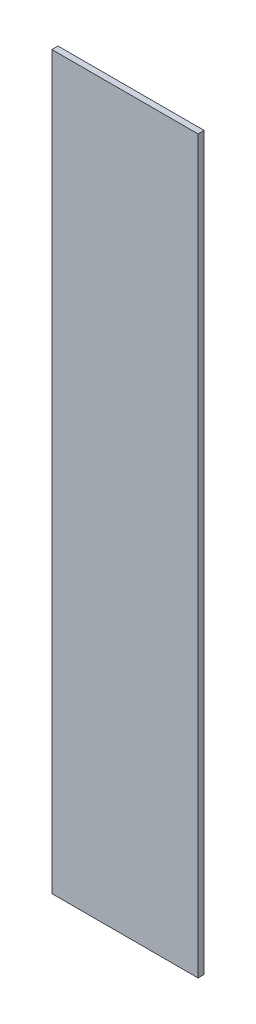
ISO-10303-21;
HEADER;
FILE_DESCRIPTION(('STEP AP214'),'2;1');
FILE_NAME('part.step','',(''),(''),'','','');
FILE_SCHEMA(('AUTOMOTIVE_DESIGN { 1 0 10303 214 1 1 1 1 }'));
ENDSEC;
DATA;
#1=APPLICATION_CONTEXT('core data for automotive mechanical design processes');
#2=APPLICATION_PROTOCOL_DEFINITION('international standard','automotive_design',2000,#1);
#3=PRODUCT_CONTEXT('',#1,'mechanical');
#4=PRODUCT('Part','Part','',(#3));
#5=PRODUCT_RELATED_PRODUCT_CATEGORY('part','',(#4));
#6=PRODUCT_DEFINITION_FORMATION('','',#4);
#7=PRODUCT_DEFINITION_CONTEXT('part definition',#1,'design');
#8=PRODUCT_DEFINITION('design','',#6,#7);
#9=PRODUCT_DEFINITION_SHAPE('','',#8);
#10=(LENGTH_UNIT() NAMED_UNIT(*) SI_UNIT(.MILLI.,.METRE.));
#11=(NAMED_UNIT(*) PLANE_ANGLE_UNIT() SI_UNIT($,.RADIAN.));
#12=(NAMED_UNIT(*) SI_UNIT($,.STERADIAN.) SOLID_ANGLE_UNIT());
#13=UNCERTAINTY_MEASURE_WITH_UNIT(LENGTH_MEASURE(1.E-05),#10,'distance_accuracy_value','');
#14=(GEOMETRIC_REPRESENTATION_CONTEXT(3) GLOBAL_UNCERTAINTY_ASSIGNED_CONTEXT((#13)) GLOBAL_UNIT_ASSIGNED_CONTEXT((#10,
#11,#12)) REPRESENTATION_CONTEXT('',''));
#15=CARTESIAN_POINT('',(0.,0.,0.));
#16=DIRECTION('',(0.,0.,1.));
#17=DIRECTION('',(1.,0.,0.));
#18=AXIS2_PLACEMENT_3D('',#15,#16,#17);
#19=CARTESIAN_POINT('',(60.,-300.,5.));
#20=DIRECTION('',(-1.,0.,0.));
#21=DIRECTION('',(0.,0.,1.));
#22=AXIS2_PLACEMENT_3D('',#19,#20,#21);
#23=PLANE('',#22);
#24=DIRECTION('',(0.,1.,0.));
#25=VECTOR('',#24,1.);
#26=CARTESIAN_POINT('',(60.,-300.,0.));
#27=LINE('',#26,#25);
#28=CARTESIAN_POINT('',(60.,-300.,0.));
#29=VERTEX_POINT('',#28);
#30=CARTESIAN_POINT('',(60.,300.,0.));
#31=VERTEX_POINT('',#30);
#32=EDGE_CURVE('E107',#29,#31,#27,.T.);
#33=ORIENTED_EDGE('',*,*,#32,.T.);
#34=DIRECTION('',(0.,0.,-1.));
#35=VECTOR('',#34,1.);
#36=CARTESIAN_POINT('',(60.,300.,5.));
#37=LINE('',#36,#35);
#38=CARTESIAN_POINT('',(60.,300.,5.));
#39=VERTEX_POINT('',#38);
#40=EDGE_CURVE('E11',#39,#31,#37,.T.);
#41=ORIENTED_EDGE('',*,*,#40,.F.);
#42=DIRECTION('',(0.,1.,0.));
#43=VECTOR('',#42,1.);
#44=CARTESIAN_POINT('',(60.,-300.,5.));
#45=LINE('',#44,#43);
#46=CARTESIAN_POINT('',(60.,-300.,5.));
#47=VERTEX_POINT('',#46);
#48=EDGE_CURVE('E91',#47,#39,#45,.T.);
#49=ORIENTED_EDGE('',*,*,#48,.F.);
#50=DIRECTION('',(0.,0.,-1.));
#51=VECTOR('',#50,1.);
#52=CARTESIAN_POINT('',(60.,-300.,5.));
#53=LINE('',#52,#51);
#54=EDGE_CURVE('E103',#47,#29,#53,.T.);
#55=ORIENTED_EDGE('',*,*,#54,.T.);
#56=EDGE_LOOP('',(#33,#41,#49,#55));
#57=FACE_BOUND('',#56,.T.);
#58=ADVANCED_FACE('F39',(#57),#23,.F.);
#59=CARTESIAN_POINT('',(-60.,300.,5.));
#60=DIRECTION('',(0.,-1.,0.));
#61=DIRECTION('',(0.,0.,-1.));
#62=AXIS2_PLACEMENT_3D('',#59,#60,#61);
#63=PLANE('',#62);
#64=DIRECTION('',(-1.,0.,0.));
#65=VECTOR('',#64,1.);
#66=CARTESIAN_POINT('',(-60.,300.,0.));
#67=LINE('',#66,#65);
#68=CARTESIAN_POINT('',(-60.,300.,0.));
#69=VERTEX_POINT('',#68);
#70=EDGE_CURVE('E96',#31,#69,#67,.T.);
#71=ORIENTED_EDGE('',*,*,#70,.T.);
#72=DIRECTION('',(0.,0.,-1.));
#73=VECTOR('',#72,1.);
#74=CARTESIAN_POINT('',(-60.,300.,5.));
#75=LINE('',#74,#73);
#76=CARTESIAN_POINT('',(-60.,300.,5.));
#77=VERTEX_POINT('',#76);
#78=EDGE_CURVE('E48',#77,#69,#75,.T.);
#79=ORIENTED_EDGE('',*,*,#78,.F.);
#80=DIRECTION('',(-1.,0.,0.));
#81=VECTOR('',#80,1.);
#82=CARTESIAN_POINT('',(-60.,300.,5.));
#83=LINE('',#82,#81);
#84=EDGE_CURVE('E86',#39,#77,#83,.T.);
#85=ORIENTED_EDGE('',*,*,#84,.F.);
#86=ORIENTED_EDGE('',*,*,#40,.T.);
#87=EDGE_LOOP('',(#71,#79,#85,#86));
#88=FACE_BOUND('',#87,.T.);
#89=ADVANCED_FACE('F95',(#88),#63,.F.);
#90=CARTESIAN_POINT('',(-60.,-300.,5.));
#91=DIRECTION('',(1.,0.,0.));
#92=DIRECTION('',(0.,0.,-1.));
#93=AXIS2_PLACEMENT_3D('',#90,#91,#92);
#94=PLANE('',#93);
#95=DIRECTION('',(0.,-1.,0.));
#96=VECTOR('',#95,1.);
#97=CARTESIAN_POINT('',(-60.,-300.,0.));
#98=LINE('',#97,#96);
#99=CARTESIAN_POINT('',(-60.,-300.,0.));
#100=VERTEX_POINT('',#99);
#101=EDGE_CURVE('E73',#69,#100,#98,.T.);
#102=ORIENTED_EDGE('',*,*,#101,.T.);
#103=DIRECTION('',(0.,0.,-1.));
#104=VECTOR('',#103,1.);
#105=CARTESIAN_POINT('',(-60.,-300.,5.));
#106=LINE('',#105,#104);
#107=CARTESIAN_POINT('',(-60.,-300.,5.));
#108=VERTEX_POINT('',#107);
#109=EDGE_CURVE('E98',#108,#100,#106,.T.);
#110=ORIENTED_EDGE('',*,*,#109,.F.);
#111=DIRECTION('',(0.,-1.,0.));
#112=VECTOR('',#111,1.);
#113=CARTESIAN_POINT('',(-60.,-300.,5.));
#114=LINE('',#113,#112);
#115=EDGE_CURVE('E89',#77,#108,#114,.T.);
#116=ORIENTED_EDGE('',*,*,#115,.F.);
#117=ORIENTED_EDGE('',*,*,#78,.T.);
#118=EDGE_LOOP('',(#102,#110,#116,#117));
#119=FACE_BOUND('',#118,.T.);
#120=ADVANCED_FACE('F99',(#119),#94,.F.);
#121=CARTESIAN_POINT('',(-60.,-300.,5.));
#122=DIRECTION('',(0.,1.,0.));
#123=DIRECTION('',(0.,0.,1.));
#124=AXIS2_PLACEMENT_3D('',#121,#122,#123);
#125=PLANE('',#124);
#126=DIRECTION('',(1.,0.,0.));
#127=VECTOR('',#126,1.);
#128=CARTESIAN_POINT('',(-60.,-300.,0.));
#129=LINE('',#128,#127);
#130=EDGE_CURVE('E79',#100,#29,#129,.T.);
#131=ORIENTED_EDGE('',*,*,#130,.T.);
#132=ORIENTED_EDGE('',*,*,#54,.F.);
#133=DIRECTION('',(1.,0.,0.));
#134=VECTOR('',#133,1.);
#135=CARTESIAN_POINT('',(-60.,-300.,5.));
#136=LINE('',#135,#134);
#137=EDGE_CURVE('E56',#108,#47,#136,.T.);
#138=ORIENTED_EDGE('',*,*,#137,.F.);
#139=ORIENTED_EDGE('',*,*,#109,.T.);
#140=EDGE_LOOP('',(#131,#132,#138,#139));
#141=FACE_BOUND('',#140,.T.);
#142=ADVANCED_FACE('F120',(#141),#125,.F.);
#143=CARTESIAN_POINT('',(0.,0.,5.));
#144=DIRECTION('',(0.,0.,-1.));
#145=DIRECTION('',(-1.,0.,0.));
#146=AXIS2_PLACEMENT_3D('',#143,#144,#145);
#147=PLANE('',#146);
#148=ORIENTED_EDGE('',*,*,#48,.T.);
#149=ORIENTED_EDGE('',*,*,#84,.T.);
#150=ORIENTED_EDGE('',*,*,#115,.T.);
#151=ORIENTED_EDGE('',*,*,#137,.T.);
#152=EDGE_LOOP('',(#148,#149,#150,#151));
#153=FACE_BOUND('',#152,.T.);
#154=ADVANCED_FACE('F87',(#153),#147,.F.);
#155=CARTESIAN_POINT('',(0.,0.,0.));
#156=DIRECTION('',(0.,0.,-1.));
#157=DIRECTION('',(-1.,0.,0.));
#158=AXIS2_PLACEMENT_3D('',#155,#156,#157);
#159=PLANE('',#158);
#160=ORIENTED_EDGE('',*,*,#32,.F.);
#161=ORIENTED_EDGE('',*,*,#130,.F.);
#162=ORIENTED_EDGE('',*,*,#101,.F.);
#163=ORIENTED_EDGE('',*,*,#70,.F.);
#164=EDGE_LOOP('',(#160,#161,#162,#163));
#165=FACE_BOUND('',#164,.T.);
#166=ADVANCED_FACE('F123',(#165),#159,.T.);
#167=CLOSED_SHELL('',(#58,#89,#120,#142,#154,#166));
#168=MANIFOLD_SOLID_BREP('B2',#167);
#169=ADVANCED_BREP_SHAPE_REPRESENTATION('',(#18,#168),#14);
#170=SHAPE_DEFINITION_REPRESENTATION(#9,#169);
ENDSEC;
END-ISO-10303-21;
